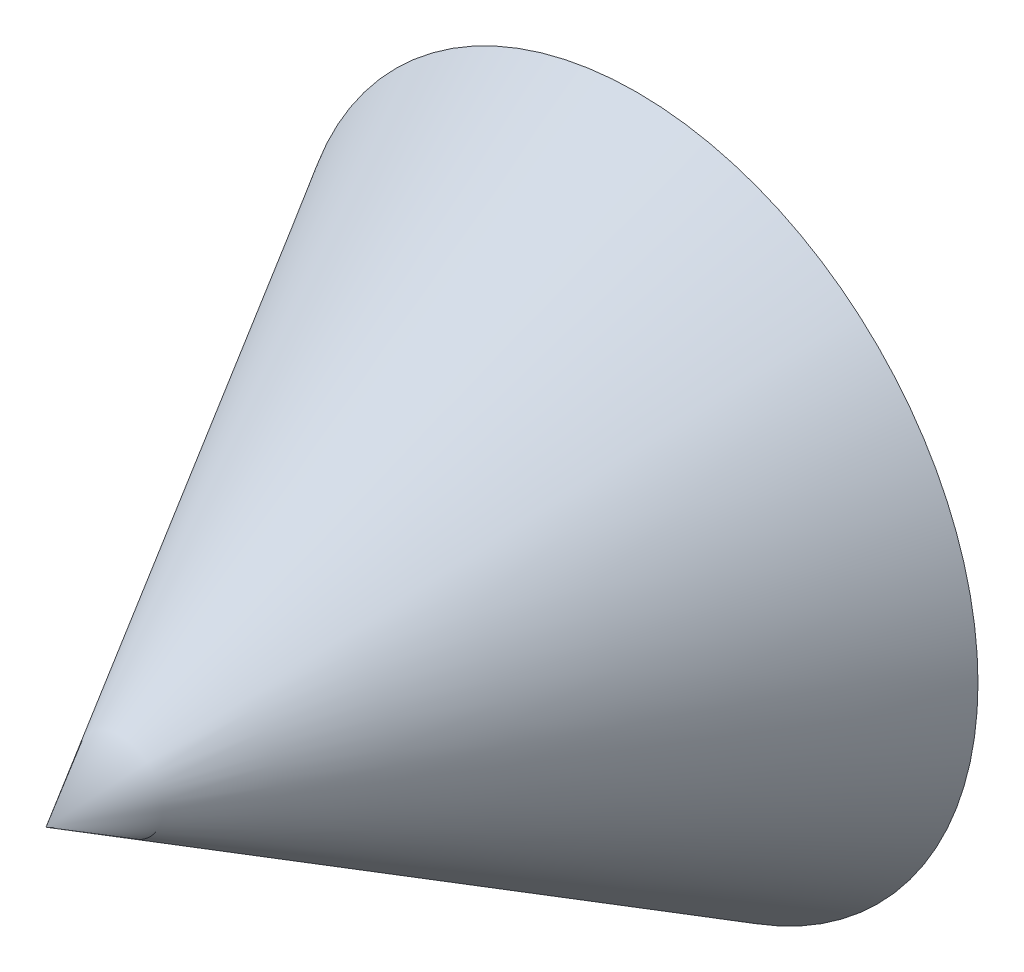
ISO-10303-21;
HEADER;
FILE_DESCRIPTION(('STEP AP214'),'2;1');
FILE_NAME('part.step','',(''),(''),'','','');
FILE_SCHEMA(('AUTOMOTIVE_DESIGN { 1 0 10303 214 1 1 1 1 }'));
ENDSEC;
DATA;
#1=APPLICATION_CONTEXT('core data for automotive mechanical design processes');
#2=APPLICATION_PROTOCOL_DEFINITION('international standard','automotive_design',2000,#1);
#3=PRODUCT_CONTEXT('',#1,'mechanical');
#4=PRODUCT('Part','Part','',(#3));
#5=PRODUCT_RELATED_PRODUCT_CATEGORY('part','',(#4));
#6=PRODUCT_DEFINITION_FORMATION('','',#4);
#7=PRODUCT_DEFINITION_CONTEXT('part definition',#1,'design');
#8=PRODUCT_DEFINITION('design','',#6,#7);
#9=PRODUCT_DEFINITION_SHAPE('','',#8);
#10=(LENGTH_UNIT() NAMED_UNIT(*) SI_UNIT(.MILLI.,.METRE.));
#11=(NAMED_UNIT(*) PLANE_ANGLE_UNIT() SI_UNIT($,.RADIAN.));
#12=(NAMED_UNIT(*) SI_UNIT($,.STERADIAN.) SOLID_ANGLE_UNIT());
#13=UNCERTAINTY_MEASURE_WITH_UNIT(LENGTH_MEASURE(1.E-05),#10,'distance_accuracy_value','');
#14=(GEOMETRIC_REPRESENTATION_CONTEXT(3) GLOBAL_UNCERTAINTY_ASSIGNED_CONTEXT((#13)) GLOBAL_UNIT_ASSIGNED_CONTEXT((#10,
#11,#12)) REPRESENTATION_CONTEXT('',''));
#15=CARTESIAN_POINT('',(0.,0.,0.));
#16=DIRECTION('',(0.,0.,1.));
#17=DIRECTION('',(1.,0.,0.));
#18=AXIS2_PLACEMENT_3D('',#15,#16,#17);
#19=CARTESIAN_POINT('',(0.,0.,-7.55));
#20=DIRECTION('',(0.,0.,-1.));
#21=DIRECTION('',(-1.,0.,0.));
#22=AXIS2_PLACEMENT_3D('',#19,#20,#21);
#23=CONICAL_SURFACE('',#22,4.35635,0.523336033861821);
#24=CARTESIAN_POINT('',(0.,0.,0.));
#25=VERTEX_POINT('',#24);
#26=VERTEX_LOOP('',#25);
#27=FACE_BOUND('',#26,.T.);
#28=CARTESIAN_POINT('',(0.,0.,-7.55));
#29=DIRECTION('',(0.,0.,1.));
#30=DIRECTION('',(1.,0.,0.));
#31=AXIS2_PLACEMENT_3D('',#28,#29,#30);
#32=CIRCLE('',#31,4.35635);
#33=CARTESIAN_POINT('',(4.35635,0.,-7.55));
#34=VERTEX_POINT('',#33);
#35=EDGE_CURVE('E11',#34,#34,#32,.T.);
#36=ORIENTED_EDGE('',*,*,#35,.T.);
#37=EDGE_LOOP('',(#36));
#38=FACE_BOUND('',#37,.T.);
#39=ADVANCED_FACE('F35',(#27,#38),#23,.T.);
#40=CARTESIAN_POINT('',(0.,0.,-7.55));
#41=DIRECTION('',(0.,0.,1.));
#42=DIRECTION('',(1.,0.,0.));
#43=AXIS2_PLACEMENT_3D('',#40,#41,#42);
#44=PLANE('',#43);
#45=ORIENTED_EDGE('',*,*,#35,.F.);
#46=EDGE_LOOP('',(#45));
#47=FACE_BOUND('',#46,.T.);
#48=ADVANCED_FACE('F44',(#47),#44,.F.);
#49=CLOSED_SHELL('',(#39,#48));
#50=MANIFOLD_SOLID_BREP('B2',#49);
#51=ADVANCED_BREP_SHAPE_REPRESENTATION('',(#18,#50),#14);
#52=SHAPE_DEFINITION_REPRESENTATION(#9,#51);
ENDSEC;
END-ISO-10303-21;
